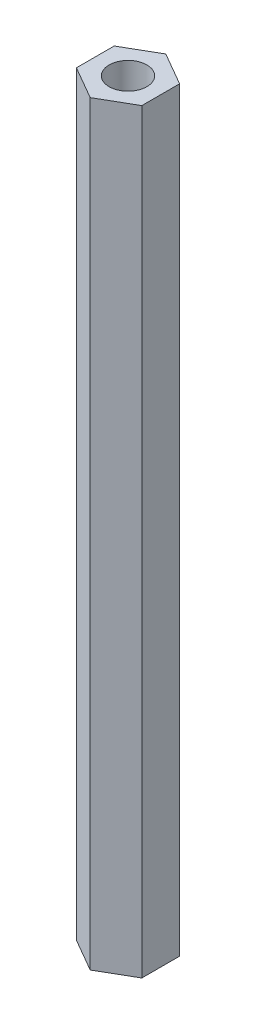
ISO-10303-21;
HEADER;
FILE_DESCRIPTION(('STEP AP214'),'2;1');
FILE_NAME('part.step','',(''),(''),'','','');
FILE_SCHEMA(('AUTOMOTIVE_DESIGN { 1 0 10303 214 1 1 1 1 }'));
ENDSEC;
DATA;
#1=APPLICATION_CONTEXT('core data for automotive mechanical design processes');
#2=APPLICATION_PROTOCOL_DEFINITION('international standard','automotive_design',2000,#1);
#3=PRODUCT_CONTEXT('',#1,'mechanical');
#4=PRODUCT('Part','Part','',(#3));
#5=PRODUCT_RELATED_PRODUCT_CATEGORY('part','',(#4));
#6=PRODUCT_DEFINITION_FORMATION('','',#4);
#7=PRODUCT_DEFINITION_CONTEXT('part definition',#1,'design');
#8=PRODUCT_DEFINITION('design','',#6,#7);
#9=PRODUCT_DEFINITION_SHAPE('','',#8);
#10=(LENGTH_UNIT() NAMED_UNIT(*) SI_UNIT(.MILLI.,.METRE.));
#11=(NAMED_UNIT(*) PLANE_ANGLE_UNIT() SI_UNIT($,.RADIAN.));
#12=(NAMED_UNIT(*) SI_UNIT($,.STERADIAN.) SOLID_ANGLE_UNIT());
#13=UNCERTAINTY_MEASURE_WITH_UNIT(LENGTH_MEASURE(1.E-05),#10,'distance_accuracy_value','');
#14=(GEOMETRIC_REPRESENTATION_CONTEXT(3) GLOBAL_UNCERTAINTY_ASSIGNED_CONTEXT((#13)) GLOBAL_UNIT_ASSIGNED_CONTEXT((#10,
#11,#12)) REPRESENTATION_CONTEXT('',''));
#15=CARTESIAN_POINT('',(0.,0.,0.));
#16=DIRECTION('',(0.,0.,1.));
#17=DIRECTION('',(1.,0.,0.));
#18=AXIS2_PLACEMENT_3D('',#15,#16,#17);
#19=CARTESIAN_POINT('',(0.,100.,-5.));
#20=DIRECTION('',(0.,1.,0.));
#21=DIRECTION('',(0.,0.,1.));
#22=AXIS2_PLACEMENT_3D('',#19,#20,#21);
#23=PLANE('',#22);
#24=DIRECTION('',(-0.866025403784439,0.,-0.5));
#25=VECTOR('',#24,1.);
#26=CARTESIAN_POINT('',(4.33012701892219,100.,-2.5));
#27=LINE('',#26,#25);
#28=CARTESIAN_POINT('',(4.33012701892219,100.,-2.5));
#29=VERTEX_POINT('',#28);
#30=CARTESIAN_POINT('',(0.,100.,-5.));
#31=VERTEX_POINT('',#30);
#32=EDGE_CURVE('E127',#29,#31,#27,.T.);
#33=ORIENTED_EDGE('',*,*,#32,.T.);
#34=DIRECTION('',(-0.866025403784439,0.,0.5));
#35=VECTOR('',#34,1.);
#36=CARTESIAN_POINT('',(0.,100.,-5.));
#37=LINE('',#36,#35);
#38=CARTESIAN_POINT('',(-4.33012701892219,100.,-2.5));
#39=VERTEX_POINT('',#38);
#40=EDGE_CURVE('E85',#31,#39,#37,.T.);
#41=ORIENTED_EDGE('',*,*,#40,.T.);
#42=DIRECTION('',(0.,0.,1.));
#43=VECTOR('',#42,1.);
#44=CARTESIAN_POINT('',(-4.33012701892219,100.,-2.5));
#45=LINE('',#44,#43);
#46=CARTESIAN_POINT('',(-4.33012701892219,100.,2.5));
#47=VERTEX_POINT('',#46);
#48=EDGE_CURVE('E98',#39,#47,#45,.T.);
#49=ORIENTED_EDGE('',*,*,#48,.T.);
#50=DIRECTION('',(0.866025403784439,0.,0.5));
#51=VECTOR('',#50,1.);
#52=CARTESIAN_POINT('',(-4.33012701892219,100.,2.5));
#53=LINE('',#52,#51);
#54=CARTESIAN_POINT('',(0.,100.,5.));
#55=VERTEX_POINT('',#54);
#56=EDGE_CURVE('E92',#47,#55,#53,.T.);
#57=ORIENTED_EDGE('',*,*,#56,.T.);
#58=DIRECTION('',(0.866025403784439,0.,-0.5));
#59=VECTOR('',#58,1.);
#60=CARTESIAN_POINT('',(0.,100.,5.));
#61=LINE('',#60,#59);
#62=CARTESIAN_POINT('',(4.33012701892219,100.,2.5));
#63=VERTEX_POINT('',#62);
#64=EDGE_CURVE('E96',#55,#63,#61,.T.);
#65=ORIENTED_EDGE('',*,*,#64,.T.);
#66=DIRECTION('',(0.,0.,-1.));
#67=VECTOR('',#66,1.);
#68=CARTESIAN_POINT('',(4.33012701892219,100.,2.5));
#69=LINE('',#68,#67);
#70=EDGE_CURVE('E48',#63,#29,#69,.T.);
#71=ORIENTED_EDGE('',*,*,#70,.T.);
#72=EDGE_LOOP('',(#33,#41,#49,#57,#65,#71));
#73=FACE_BOUND('',#72,.T.);
#74=CARTESIAN_POINT('',(0.,100.,0.));
#75=DIRECTION('',(0.,1.,0.));
#76=DIRECTION('',(0.,0.,1.));
#77=AXIS2_PLACEMENT_3D('',#74,#75,#76);
#78=CIRCLE('',#77,2.5);
#79=CARTESIAN_POINT('',(0.,100.,2.5));
#80=VERTEX_POINT('',#79);
#81=EDGE_CURVE('E120',#80,#80,#78,.T.);
#82=ORIENTED_EDGE('',*,*,#81,.F.);
#83=EDGE_LOOP('',(#82));
#84=FACE_BOUND('',#83,.T.);
#85=ADVANCED_FACE('F31',(#73,#84),#23,.T.);
#86=CARTESIAN_POINT('',(0.,0.,-5.));
#87=DIRECTION('',(0.,1.,0.));
#88=DIRECTION('',(0.,0.,1.));
#89=AXIS2_PLACEMENT_3D('',#86,#87,#88);
#90=PLANE('',#89);
#91=DIRECTION('',(-0.866025403784439,0.,-0.5));
#92=VECTOR('',#91,1.);
#93=CARTESIAN_POINT('',(4.33012701892219,0.,-2.5));
#94=LINE('',#93,#92);
#95=CARTESIAN_POINT('',(4.33012701892219,0.,-2.5));
#96=VERTEX_POINT('',#95);
#97=CARTESIAN_POINT('',(0.,0.,-5.));
#98=VERTEX_POINT('',#97);
#99=EDGE_CURVE('E116',#96,#98,#94,.T.);
#100=ORIENTED_EDGE('',*,*,#99,.F.);
#101=DIRECTION('',(0.,0.,-1.));
#102=VECTOR('',#101,1.);
#103=CARTESIAN_POINT('',(4.33012701892219,0.,2.5));
#104=LINE('',#103,#102);
#105=CARTESIAN_POINT('',(4.33012701892219,0.,2.5));
#106=VERTEX_POINT('',#105);
#107=EDGE_CURVE('E77',#106,#96,#104,.T.);
#108=ORIENTED_EDGE('',*,*,#107,.F.);
#109=DIRECTION('',(0.866025403784439,0.,-0.5));
#110=VECTOR('',#109,1.);
#111=CARTESIAN_POINT('',(0.,0.,5.));
#112=LINE('',#111,#110);
#113=CARTESIAN_POINT('',(0.,0.,5.));
#114=VERTEX_POINT('',#113);
#115=EDGE_CURVE('E71',#114,#106,#112,.T.);
#116=ORIENTED_EDGE('',*,*,#115,.F.);
#117=DIRECTION('',(0.866025403784439,0.,0.5));
#118=VECTOR('',#117,1.);
#119=CARTESIAN_POINT('',(-4.33012701892219,0.,2.5));
#120=LINE('',#119,#118);
#121=CARTESIAN_POINT('',(-4.33012701892219,0.,2.5));
#122=VERTEX_POINT('',#121);
#123=EDGE_CURVE('E106',#122,#114,#120,.T.);
#124=ORIENTED_EDGE('',*,*,#123,.F.);
#125=DIRECTION('',(0.,0.,1.));
#126=VECTOR('',#125,1.);
#127=CARTESIAN_POINT('',(-4.33012701892219,0.,-2.5));
#128=LINE('',#127,#126);
#129=CARTESIAN_POINT('',(-4.33012701892219,0.,-2.5));
#130=VERTEX_POINT('',#129);
#131=EDGE_CURVE('E122',#130,#122,#128,.T.);
#132=ORIENTED_EDGE('',*,*,#131,.F.);
#133=DIRECTION('',(-0.866025403784439,0.,0.5));
#134=VECTOR('',#133,1.);
#135=CARTESIAN_POINT('',(0.,0.,-5.));
#136=LINE('',#135,#134);
#137=EDGE_CURVE('E119',#98,#130,#136,.T.);
#138=ORIENTED_EDGE('',*,*,#137,.F.);
#139=EDGE_LOOP('',(#100,#108,#116,#124,#132,#138));
#140=FACE_BOUND('',#139,.T.);
#141=CARTESIAN_POINT('',(0.,0.,0.));
#142=DIRECTION('',(0.,1.,0.));
#143=DIRECTION('',(0.,0.,1.));
#144=AXIS2_PLACEMENT_3D('',#141,#142,#143);
#145=CIRCLE('',#144,2.5);
#146=CARTESIAN_POINT('',(0.,0.,2.5));
#147=VERTEX_POINT('',#146);
#148=EDGE_CURVE('E220',#147,#147,#145,.T.);
#149=ORIENTED_EDGE('',*,*,#148,.T.);
#150=EDGE_LOOP('',(#149));
#151=FACE_BOUND('',#150,.T.);
#152=ADVANCED_FACE('F136',(#140,#151),#90,.F.);
#153=CARTESIAN_POINT('',(4.33012701892219,100.,-2.5));
#154=DIRECTION('',(-0.5,0.,0.866025403784439));
#155=DIRECTION('',(0.866025403784439,0.,0.5));
#156=AXIS2_PLACEMENT_3D('',#153,#154,#155);
#157=PLANE('',#156);
#158=ORIENTED_EDGE('',*,*,#99,.T.);
#159=DIRECTION('',(0.,-1.,0.));
#160=VECTOR('',#159,1.);
#161=CARTESIAN_POINT('',(0.,100.,-5.));
#162=LINE('',#161,#160);
#163=EDGE_CURVE('E11',#31,#98,#162,.T.);
#164=ORIENTED_EDGE('',*,*,#163,.F.);
#165=ORIENTED_EDGE('',*,*,#32,.F.);
#166=DIRECTION('',(0.,-1.,0.));
#167=VECTOR('',#166,1.);
#168=CARTESIAN_POINT('',(4.33012701892219,100.,-2.5));
#169=LINE('',#168,#167);
#170=EDGE_CURVE('E112',#29,#96,#169,.T.);
#171=ORIENTED_EDGE('',*,*,#170,.T.);
#172=EDGE_LOOP('',(#158,#164,#165,#171));
#173=FACE_BOUND('',#172,.T.);
#174=ADVANCED_FACE('F33',(#173),#157,.F.);
#175=CARTESIAN_POINT('',(0.,100.,-5.));
#176=DIRECTION('',(0.5,0.,0.866025403784439));
#177=DIRECTION('',(0.866025403784439,0.,-0.5));
#178=AXIS2_PLACEMENT_3D('',#175,#176,#177);
#179=PLANE('',#178);
#180=ORIENTED_EDGE('',*,*,#137,.T.);
#181=DIRECTION('',(0.,-1.,0.));
#182=VECTOR('',#181,1.);
#183=CARTESIAN_POINT('',(-4.33012701892219,100.,-2.5));
#184=LINE('',#183,#182);
#185=EDGE_CURVE('E40',#39,#130,#184,.T.);
#186=ORIENTED_EDGE('',*,*,#185,.F.);
#187=ORIENTED_EDGE('',*,*,#40,.F.);
#188=ORIENTED_EDGE('',*,*,#163,.T.);
#189=EDGE_LOOP('',(#180,#186,#187,#188));
#190=FACE_BOUND('',#189,.T.);
#191=ADVANCED_FACE('F161',(#190),#179,.F.);
#192=CARTESIAN_POINT('',(-4.33012701892219,100.,-2.5));
#193=DIRECTION('',(1.,0.,0.));
#194=DIRECTION('',(0.,0.,-1.));
#195=AXIS2_PLACEMENT_3D('',#192,#193,#194);
#196=PLANE('',#195);
#197=ORIENTED_EDGE('',*,*,#131,.T.);
#198=DIRECTION('',(0.,-1.,0.));
#199=VECTOR('',#198,1.);
#200=CARTESIAN_POINT('',(-4.33012701892219,100.,2.5));
#201=LINE('',#200,#199);
#202=EDGE_CURVE('E107',#47,#122,#201,.T.);
#203=ORIENTED_EDGE('',*,*,#202,.F.);
#204=ORIENTED_EDGE('',*,*,#48,.F.);
#205=ORIENTED_EDGE('',*,*,#185,.T.);
#206=EDGE_LOOP('',(#197,#203,#204,#205));
#207=FACE_BOUND('',#206,.T.);
#208=ADVANCED_FACE('F133',(#207),#196,.F.);
#209=CARTESIAN_POINT('',(-4.33012701892219,100.,2.5));
#210=DIRECTION('',(0.5,0.,-0.866025403784439));
#211=DIRECTION('',(-0.866025403784439,0.,-0.5));
#212=AXIS2_PLACEMENT_3D('',#209,#210,#211);
#213=PLANE('',#212);
#214=ORIENTED_EDGE('',*,*,#123,.T.);
#215=DIRECTION('',(0.,-1.,0.));
#216=VECTOR('',#215,1.);
#217=CARTESIAN_POINT('',(0.,100.,5.));
#218=LINE('',#217,#216);
#219=EDGE_CURVE('E103',#55,#114,#218,.T.);
#220=ORIENTED_EDGE('',*,*,#219,.F.);
#221=ORIENTED_EDGE('',*,*,#56,.F.);
#222=ORIENTED_EDGE('',*,*,#202,.T.);
#223=EDGE_LOOP('',(#214,#220,#221,#222));
#224=FACE_BOUND('',#223,.T.);
#225=ADVANCED_FACE('F104',(#224),#213,.F.);
#226=CARTESIAN_POINT('',(0.,100.,5.));
#227=DIRECTION('',(-0.5,0.,-0.866025403784439));
#228=DIRECTION('',(-0.866025403784439,0.,0.5));
#229=AXIS2_PLACEMENT_3D('',#226,#227,#228);
#230=PLANE('',#229);
#231=ORIENTED_EDGE('',*,*,#115,.T.);
#232=DIRECTION('',(0.,-1.,0.));
#233=VECTOR('',#232,1.);
#234=CARTESIAN_POINT('',(4.33012701892219,100.,2.5));
#235=LINE('',#234,#233);
#236=EDGE_CURVE('E108',#63,#106,#235,.T.);
#237=ORIENTED_EDGE('',*,*,#236,.F.);
#238=ORIENTED_EDGE('',*,*,#64,.F.);
#239=ORIENTED_EDGE('',*,*,#219,.T.);
#240=EDGE_LOOP('',(#231,#237,#238,#239));
#241=FACE_BOUND('',#240,.T.);
#242=ADVANCED_FACE('F110',(#241),#230,.F.);
#243=CARTESIAN_POINT('',(4.33012701892219,100.,2.5));
#244=DIRECTION('',(-1.,0.,0.));
#245=DIRECTION('',(0.,0.,1.));
#246=AXIS2_PLACEMENT_3D('',#243,#244,#245);
#247=PLANE('',#246);
#248=ORIENTED_EDGE('',*,*,#107,.T.);
#249=ORIENTED_EDGE('',*,*,#170,.F.);
#250=ORIENTED_EDGE('',*,*,#70,.F.);
#251=ORIENTED_EDGE('',*,*,#236,.T.);
#252=EDGE_LOOP('',(#248,#249,#250,#251));
#253=FACE_BOUND('',#252,.T.);
#254=ADVANCED_FACE('F141',(#253),#247,.F.);
#255=CARTESIAN_POINT('',(0.,100.,0.));
#256=DIRECTION('',(0.,-1.,0.));
#257=DIRECTION('',(0.,0.,-1.));
#258=AXIS2_PLACEMENT_3D('',#255,#256,#257);
#259=CYLINDRICAL_SURFACE('',#258,2.5);
#260=ORIENTED_EDGE('',*,*,#81,.T.);
#261=EDGE_LOOP('',(#260));
#262=FACE_BOUND('',#261,.T.);
#263=ORIENTED_EDGE('',*,*,#148,.F.);
#264=EDGE_LOOP('',(#263));
#265=FACE_BOUND('',#264,.T.);
#266=ADVANCED_FACE('F143',(#262,#265),#259,.F.);
#267=CLOSED_SHELL('',(#85,#152,#174,#191,#208,#225,#242,#254,#266));
#268=MANIFOLD_SOLID_BREP('B2',#267);
#269=ADVANCED_BREP_SHAPE_REPRESENTATION('',(#18,#268),#14);
#270=SHAPE_DEFINITION_REPRESENTATION(#9,#269);
ENDSEC;
END-ISO-10303-21;
